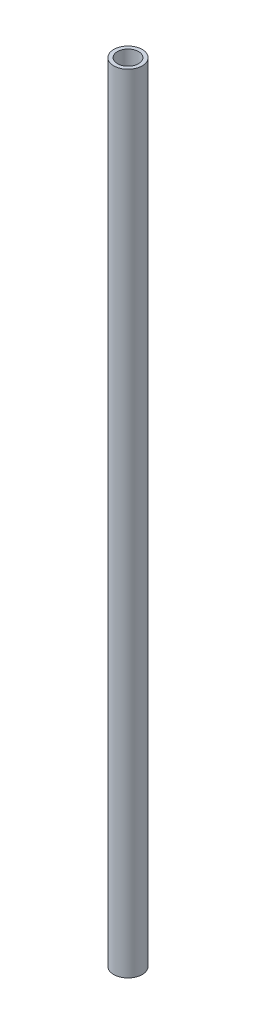
ISO-10303-21;
HEADER;
FILE_DESCRIPTION(('STEP AP214'),'2;1');
FILE_NAME('part.step','',(''),(''),'','','');
FILE_SCHEMA(('AUTOMOTIVE_DESIGN { 1 0 10303 214 1 1 1 1 }'));
ENDSEC;
DATA;
#1=APPLICATION_CONTEXT('core data for automotive mechanical design processes');
#2=APPLICATION_PROTOCOL_DEFINITION('international standard','automotive_design',2000,#1);
#3=PRODUCT_CONTEXT('',#1,'mechanical');
#4=PRODUCT('Part','Part','',(#3));
#5=PRODUCT_RELATED_PRODUCT_CATEGORY('part','',(#4));
#6=PRODUCT_DEFINITION_FORMATION('','',#4);
#7=PRODUCT_DEFINITION_CONTEXT('part definition',#1,'design');
#8=PRODUCT_DEFINITION('design','',#6,#7);
#9=PRODUCT_DEFINITION_SHAPE('','',#8);
#10=(LENGTH_UNIT() NAMED_UNIT(*) SI_UNIT(.MILLI.,.METRE.));
#11=(NAMED_UNIT(*) PLANE_ANGLE_UNIT() SI_UNIT($,.RADIAN.));
#12=(NAMED_UNIT(*) SI_UNIT($,.STERADIAN.) SOLID_ANGLE_UNIT());
#13=UNCERTAINTY_MEASURE_WITH_UNIT(LENGTH_MEASURE(1.E-05),#10,'distance_accuracy_value','');
#14=(GEOMETRIC_REPRESENTATION_CONTEXT(3) GLOBAL_UNCERTAINTY_ASSIGNED_CONTEXT((#13)) GLOBAL_UNIT_ASSIGNED_CONTEXT((#10,
#11,#12)) REPRESENTATION_CONTEXT('',''));
#15=CARTESIAN_POINT('',(0.,0.,0.));
#16=DIRECTION('',(0.,0.,1.));
#17=DIRECTION('',(1.,0.,0.));
#18=AXIS2_PLACEMENT_3D('',#15,#16,#17);
#19=CARTESIAN_POINT('',(0.,590.,0.));
#20=DIRECTION('',(0.,1.,0.));
#21=DIRECTION('',(0.,0.,1.));
#22=AXIS2_PLACEMENT_3D('',#19,#20,#21);
#23=PLANE('',#22);
#24=CARTESIAN_POINT('',(0.,590.,0.));
#25=DIRECTION('',(0.,1.,0.));
#26=DIRECTION('',(0.,0.,1.));
#27=AXIS2_PLACEMENT_3D('',#24,#25,#26);
#28=CIRCLE('',#27,10.668);
#29=CARTESIAN_POINT('',(0.,590.,10.668));
#30=VERTEX_POINT('',#29);
#31=EDGE_CURVE('E10',#30,#30,#28,.T.);
#32=ORIENTED_EDGE('',*,*,#31,.T.);
#33=EDGE_LOOP('',(#32));
#34=FACE_BOUND('',#33,.T.);
#35=CARTESIAN_POINT('',(0.,590.,0.));
#36=DIRECTION('',(0.,1.,0.));
#37=DIRECTION('',(0.,0.,1.));
#38=AXIS2_PLACEMENT_3D('',#35,#36,#37);
#39=CIRCLE('',#38,7.8994);
#40=CARTESIAN_POINT('',(0.,590.,7.8994));
#41=VERTEX_POINT('',#40);
#42=EDGE_CURVE('E44',#41,#41,#39,.T.);
#43=ORIENTED_EDGE('',*,*,#42,.F.);
#44=EDGE_LOOP('',(#43));
#45=FACE_BOUND('',#44,.T.);
#46=ADVANCED_FACE('F33',(#34,#45),#23,.T.);
#47=CARTESIAN_POINT('',(0.,0.,0.));
#48=DIRECTION('',(0.,1.,0.));
#49=DIRECTION('',(0.,0.,1.));
#50=AXIS2_PLACEMENT_3D('',#47,#48,#49);
#51=PLANE('',#50);
#52=CARTESIAN_POINT('',(0.,0.,0.));
#53=DIRECTION('',(0.,1.,0.));
#54=DIRECTION('',(0.,0.,1.));
#55=AXIS2_PLACEMENT_3D('',#52,#53,#54);
#56=CIRCLE('',#55,10.668);
#57=CARTESIAN_POINT('',(0.,0.,10.668));
#58=VERTEX_POINT('',#57);
#59=EDGE_CURVE('E37',#58,#58,#56,.T.);
#60=ORIENTED_EDGE('',*,*,#59,.F.);
#61=EDGE_LOOP('',(#60));
#62=FACE_BOUND('',#61,.T.);
#63=CARTESIAN_POINT('',(0.,0.,0.));
#64=DIRECTION('',(0.,1.,0.));
#65=DIRECTION('',(0.,0.,1.));
#66=AXIS2_PLACEMENT_3D('',#63,#64,#65);
#67=CIRCLE('',#66,7.8994);
#68=CARTESIAN_POINT('',(0.,0.,7.8994));
#69=VERTEX_POINT('',#68);
#70=EDGE_CURVE('E46',#69,#69,#67,.T.);
#71=ORIENTED_EDGE('',*,*,#70,.T.);
#72=EDGE_LOOP('',(#71));
#73=FACE_BOUND('',#72,.T.);
#74=ADVANCED_FACE('F56',(#62,#73),#51,.F.);
#75=CARTESIAN_POINT('',(0.,590.,0.));
#76=DIRECTION('',(0.,-1.,0.));
#77=DIRECTION('',(0.,0.,-1.));
#78=AXIS2_PLACEMENT_3D('',#75,#76,#77);
#79=CYLINDRICAL_SURFACE('',#78,10.668);
#80=ORIENTED_EDGE('',*,*,#31,.F.);
#81=EDGE_LOOP('',(#80));
#82=FACE_BOUND('',#81,.T.);
#83=ORIENTED_EDGE('',*,*,#59,.T.);
#84=EDGE_LOOP('',(#83));
#85=FACE_BOUND('',#84,.T.);
#86=ADVANCED_FACE('F35',(#82,#85),#79,.T.);
#87=CARTESIAN_POINT('',(0.,590.,0.));
#88=DIRECTION('',(0.,-1.,0.));
#89=DIRECTION('',(0.,0.,-1.));
#90=AXIS2_PLACEMENT_3D('',#87,#88,#89);
#91=CYLINDRICAL_SURFACE('',#90,7.8994);
#92=ORIENTED_EDGE('',*,*,#42,.T.);
#93=EDGE_LOOP('',(#92));
#94=FACE_BOUND('',#93,.T.);
#95=ORIENTED_EDGE('',*,*,#70,.F.);
#96=EDGE_LOOP('',(#95));
#97=FACE_BOUND('',#96,.T.);
#98=ADVANCED_FACE('F52',(#94,#97),#91,.F.);
#99=CLOSED_SHELL('',(#46,#74,#86,#98));
#100=MANIFOLD_SOLID_BREP('B2',#99);
#101=ADVANCED_BREP_SHAPE_REPRESENTATION('',(#18,#100),#14);
#102=SHAPE_DEFINITION_REPRESENTATION(#9,#101);
ENDSEC;
END-ISO-10303-21;
